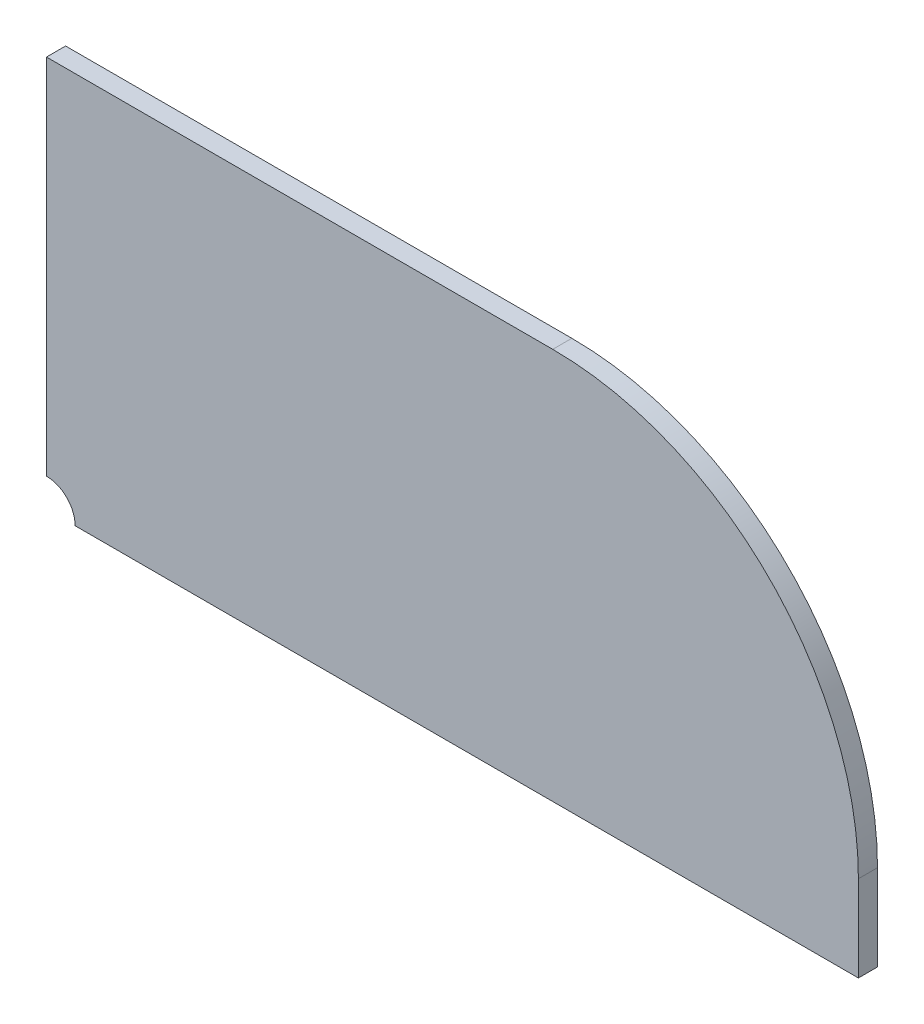
ISO-10303-21;
HEADER;
FILE_DESCRIPTION(('STEP AP214'),'2;1');
FILE_NAME('part.step','',(''),(''),'','','');
FILE_SCHEMA(('AUTOMOTIVE_DESIGN { 1 0 10303 214 1 1 1 1 }'));
ENDSEC;
DATA;
#1=APPLICATION_CONTEXT('core data for automotive mechanical design processes');
#2=APPLICATION_PROTOCOL_DEFINITION('international standard','automotive_design',2000,#1);
#3=PRODUCT_CONTEXT('',#1,'mechanical');
#4=PRODUCT('Part','Part','',(#3));
#5=PRODUCT_RELATED_PRODUCT_CATEGORY('part','',(#4));
#6=PRODUCT_DEFINITION_FORMATION('','',#4);
#7=PRODUCT_DEFINITION_CONTEXT('part definition',#1,'design');
#8=PRODUCT_DEFINITION('design','',#6,#7);
#9=PRODUCT_DEFINITION_SHAPE('','',#8);
#10=(LENGTH_UNIT() NAMED_UNIT(*) SI_UNIT(.MILLI.,.METRE.));
#11=(NAMED_UNIT(*) PLANE_ANGLE_UNIT() SI_UNIT($,.RADIAN.));
#12=(NAMED_UNIT(*) SI_UNIT($,.STERADIAN.) SOLID_ANGLE_UNIT());
#13=UNCERTAINTY_MEASURE_WITH_UNIT(LENGTH_MEASURE(1.E-05),#10,'distance_accuracy_value','');
#14=(GEOMETRIC_REPRESENTATION_CONTEXT(3) GLOBAL_UNCERTAINTY_ASSIGNED_CONTEXT((#13)) GLOBAL_UNIT_ASSIGNED_CONTEXT((#10,
#11,#12)) REPRESENTATION_CONTEXT('',''));
#15=CARTESIAN_POINT('',(0.,0.,0.));
#16=DIRECTION('',(0.,0.,1.));
#17=DIRECTION('',(1.,0.,0.));
#18=AXIS2_PLACEMENT_3D('',#15,#16,#17);
#19=CARTESIAN_POINT('',(26.5,4.5,-1.));
#20=DIRECTION('',(0.,0.,1.));
#21=DIRECTION('',(1.,0.,0.));
#22=AXIS2_PLACEMENT_3D('',#19,#20,#21);
#23=CYLINDRICAL_SURFACE('',#22,16.);
#24=CARTESIAN_POINT('',(26.5,4.5,0.));
#25=DIRECTION('',(0.,0.,1.));
#26=DIRECTION('',(1.,0.,0.));
#27=AXIS2_PLACEMENT_3D('',#24,#25,#26);
#28=CIRCLE('',#27,16.);
#29=CARTESIAN_POINT('',(42.5,4.5,0.));
#30=VERTEX_POINT('',#29);
#31=CARTESIAN_POINT('',(26.5,20.5,0.));
#32=VERTEX_POINT('',#31);
#33=EDGE_CURVE('E124',#30,#32,#28,.T.);
#34=ORIENTED_EDGE('',*,*,#33,.F.);
#35=DIRECTION('',(0.,0.,1.));
#36=VECTOR('',#35,1.);
#37=CARTESIAN_POINT('',(42.5,4.5,-1.));
#38=LINE('',#37,#36);
#39=CARTESIAN_POINT('',(42.5,4.5,-1.));
#40=VERTEX_POINT('',#39);
#41=EDGE_CURVE('E11',#40,#30,#38,.T.);
#42=ORIENTED_EDGE('',*,*,#41,.F.);
#43=CARTESIAN_POINT('',(26.5,4.5,-1.));
#44=DIRECTION('',(0.,0.,1.));
#45=DIRECTION('',(1.,0.,0.));
#46=AXIS2_PLACEMENT_3D('',#43,#44,#45);
#47=CIRCLE('',#46,16.);
#48=CARTESIAN_POINT('',(26.5,20.5,-1.));
#49=VERTEX_POINT('',#48);
#50=EDGE_CURVE('E138',#40,#49,#47,.T.);
#51=ORIENTED_EDGE('',*,*,#50,.T.);
#52=DIRECTION('',(0.,0.,1.));
#53=VECTOR('',#52,1.);
#54=CARTESIAN_POINT('',(26.5,20.5,-1.));
#55=LINE('',#54,#53);
#56=EDGE_CURVE('E42',#49,#32,#55,.T.);
#57=ORIENTED_EDGE('',*,*,#56,.T.);
#58=EDGE_LOOP('',(#34,#42,#51,#57));
#59=FACE_BOUND('',#58,.T.);
#60=ADVANCED_FACE('F39',(#59),#23,.T.);
#61=CARTESIAN_POINT('',(42.5,4.5,-1.));
#62=DIRECTION('',(1.,0.,0.));
#63=DIRECTION('',(0.,0.,-1.));
#64=AXIS2_PLACEMENT_3D('',#61,#62,#63);
#65=PLANE('',#64);
#66=DIRECTION('',(0.,1.,0.));
#67=VECTOR('',#66,1.);
#68=CARTESIAN_POINT('',(42.5,4.5,0.));
#69=LINE('',#68,#67);
#70=CARTESIAN_POINT('',(42.5,0.,0.));
#71=VERTEX_POINT('',#70);
#72=EDGE_CURVE('E136',#71,#30,#69,.T.);
#73=ORIENTED_EDGE('',*,*,#72,.F.);
#74=DIRECTION('',(0.,0.,1.));
#75=VECTOR('',#74,1.);
#76=CARTESIAN_POINT('',(42.5,0.,-1.));
#77=LINE('',#76,#75);
#78=CARTESIAN_POINT('',(42.5,0.,-1.));
#79=VERTEX_POINT('',#78);
#80=EDGE_CURVE('E48',#79,#71,#77,.T.);
#81=ORIENTED_EDGE('',*,*,#80,.F.);
#82=DIRECTION('',(0.,1.,0.));
#83=VECTOR('',#82,1.);
#84=CARTESIAN_POINT('',(42.5,4.5,-1.));
#85=LINE('',#84,#83);
#86=EDGE_CURVE('E114',#79,#40,#85,.T.);
#87=ORIENTED_EDGE('',*,*,#86,.T.);
#88=ORIENTED_EDGE('',*,*,#41,.T.);
#89=EDGE_LOOP('',(#73,#81,#87,#88));
#90=FACE_BOUND('',#89,.T.);
#91=ADVANCED_FACE('F146',(#90),#65,.T.);
#92=CARTESIAN_POINT('',(42.5,0.,-1.));
#93=DIRECTION('',(0.,-1.,0.));
#94=DIRECTION('',(1.,0.,0.));
#95=AXIS2_PLACEMENT_3D('',#92,#93,#94);
#96=PLANE('',#95);
#97=DIRECTION('',(1.,0.,0.));
#98=VECTOR('',#97,1.);
#99=CARTESIAN_POINT('',(42.5,0.,0.));
#100=LINE('',#99,#98);
#101=CARTESIAN_POINT('',(1.5,0.,0.));
#102=VERTEX_POINT('',#101);
#103=EDGE_CURVE('E101',#102,#71,#100,.T.);
#104=ORIENTED_EDGE('',*,*,#103,.F.);
#105=DIRECTION('',(0.,0.,1.));
#106=VECTOR('',#105,1.);
#107=CARTESIAN_POINT('',(1.5,0.,-1.));
#108=LINE('',#107,#106);
#109=CARTESIAN_POINT('',(1.5,0.,-1.));
#110=VERTEX_POINT('',#109);
#111=EDGE_CURVE('E96',#110,#102,#108,.T.);
#112=ORIENTED_EDGE('',*,*,#111,.F.);
#113=DIRECTION('',(1.,0.,0.));
#114=VECTOR('',#113,1.);
#115=CARTESIAN_POINT('',(42.5,0.,-1.));
#116=LINE('',#115,#114);
#117=EDGE_CURVE('E99',#110,#79,#116,.T.);
#118=ORIENTED_EDGE('',*,*,#117,.T.);
#119=ORIENTED_EDGE('',*,*,#80,.T.);
#120=EDGE_LOOP('',(#104,#112,#118,#119));
#121=FACE_BOUND('',#120,.T.);
#122=ADVANCED_FACE('F98',(#121),#96,.T.);
#123=CARTESIAN_POINT('',(0.,0.,-1.));
#124=DIRECTION('',(0.,0.,1.));
#125=DIRECTION('',(1.,0.,0.));
#126=AXIS2_PLACEMENT_3D('',#123,#124,#125);
#127=CYLINDRICAL_SURFACE('',#126,1.5);
#128=CARTESIAN_POINT('',(0.,0.,0.));
#129=DIRECTION('',(0.,0.,-1.));
#130=DIRECTION('',(1.,0.,0.));
#131=AXIS2_PLACEMENT_3D('',#128,#129,#130);
#132=CIRCLE('',#131,1.5);
#133=CARTESIAN_POINT('',(0.,1.5,0.));
#134=VERTEX_POINT('',#133);
#135=EDGE_CURVE('E133',#134,#102,#132,.T.);
#136=ORIENTED_EDGE('',*,*,#135,.F.);
#137=DIRECTION('',(0.,0.,1.));
#138=VECTOR('',#137,1.);
#139=CARTESIAN_POINT('',(0.,1.5,-1.));
#140=LINE('',#139,#138);
#141=CARTESIAN_POINT('',(0.,1.5,-1.));
#142=VERTEX_POINT('',#141);
#143=EDGE_CURVE('E106',#142,#134,#140,.T.);
#144=ORIENTED_EDGE('',*,*,#143,.F.);
#145=CARTESIAN_POINT('',(0.,0.,-1.));
#146=DIRECTION('',(0.,0.,-1.));
#147=DIRECTION('',(1.,0.,0.));
#148=AXIS2_PLACEMENT_3D('',#145,#146,#147);
#149=CIRCLE('',#148,1.5);
#150=EDGE_CURVE('E112',#142,#110,#149,.T.);
#151=ORIENTED_EDGE('',*,*,#150,.T.);
#152=ORIENTED_EDGE('',*,*,#111,.T.);
#153=EDGE_LOOP('',(#136,#144,#151,#152));
#154=FACE_BOUND('',#153,.T.);
#155=ADVANCED_FACE('F116',(#154),#127,.F.);
#156=CARTESIAN_POINT('',(0.,1.5,-1.));
#157=DIRECTION('',(-1.,0.,0.));
#158=DIRECTION('',(0.,0.,1.));
#159=AXIS2_PLACEMENT_3D('',#156,#157,#158);
#160=PLANE('',#159);
#161=DIRECTION('',(0.,-1.,0.));
#162=VECTOR('',#161,1.);
#163=CARTESIAN_POINT('',(0.,1.5,0.));
#164=LINE('',#163,#162);
#165=CARTESIAN_POINT('',(0.,20.5,0.));
#166=VERTEX_POINT('',#165);
#167=EDGE_CURVE('E130',#166,#134,#164,.T.);
#168=ORIENTED_EDGE('',*,*,#167,.F.);
#169=DIRECTION('',(0.,0.,1.));
#170=VECTOR('',#169,1.);
#171=CARTESIAN_POINT('',(0.,20.5,-1.));
#172=LINE('',#171,#170);
#173=CARTESIAN_POINT('',(0.,20.5,-1.));
#174=VERTEX_POINT('',#173);
#175=EDGE_CURVE('E141',#174,#166,#172,.T.);
#176=ORIENTED_EDGE('',*,*,#175,.F.);
#177=DIRECTION('',(0.,-1.,0.));
#178=VECTOR('',#177,1.);
#179=CARTESIAN_POINT('',(0.,1.5,-1.));
#180=LINE('',#179,#178);
#181=EDGE_CURVE('E117',#174,#142,#180,.T.);
#182=ORIENTED_EDGE('',*,*,#181,.T.);
#183=ORIENTED_EDGE('',*,*,#143,.T.);
#184=EDGE_LOOP('',(#168,#176,#182,#183));
#185=FACE_BOUND('',#184,.T.);
#186=ADVANCED_FACE('F159',(#185),#160,.T.);
#187=CARTESIAN_POINT('',(0.,20.5,-1.));
#188=DIRECTION('',(0.,1.,0.));
#189=DIRECTION('',(0.,0.,1.));
#190=AXIS2_PLACEMENT_3D('',#187,#188,#189);
#191=PLANE('',#190);
#192=DIRECTION('',(-1.,0.,0.));
#193=VECTOR('',#192,1.);
#194=CARTESIAN_POINT('',(0.,20.5,0.));
#195=LINE('',#194,#193);
#196=EDGE_CURVE('E127',#32,#166,#195,.T.);
#197=ORIENTED_EDGE('',*,*,#196,.F.);
#198=ORIENTED_EDGE('',*,*,#56,.F.);
#199=DIRECTION('',(-1.,0.,0.));
#200=VECTOR('',#199,1.);
#201=CARTESIAN_POINT('',(0.,20.5,-1.));
#202=LINE('',#201,#200);
#203=EDGE_CURVE('E119',#49,#174,#202,.T.);
#204=ORIENTED_EDGE('',*,*,#203,.T.);
#205=ORIENTED_EDGE('',*,*,#175,.T.);
#206=EDGE_LOOP('',(#197,#198,#204,#205));
#207=FACE_BOUND('',#206,.T.);
#208=ADVANCED_FACE('F143',(#207),#191,.T.);
#209=CARTESIAN_POINT('',(26.5,4.5,-1.));
#210=DIRECTION('',(0.,0.,1.));
#211=DIRECTION('',(1.,0.,0.));
#212=AXIS2_PLACEMENT_3D('',#209,#210,#211);
#213=PLANE('',#212);
#214=ORIENTED_EDGE('',*,*,#50,.F.);
#215=ORIENTED_EDGE('',*,*,#86,.F.);
#216=ORIENTED_EDGE('',*,*,#117,.F.);
#217=ORIENTED_EDGE('',*,*,#150,.F.);
#218=ORIENTED_EDGE('',*,*,#181,.F.);
#219=ORIENTED_EDGE('',*,*,#203,.F.);
#220=EDGE_LOOP('',(#214,#215,#216,#217,#218,#219));
#221=FACE_BOUND('',#220,.T.);
#222=ADVANCED_FACE('F110',(#221),#213,.F.);
#223=CARTESIAN_POINT('',(26.5,4.5,0.));
#224=DIRECTION('',(0.,0.,1.));
#225=DIRECTION('',(1.,0.,0.));
#226=AXIS2_PLACEMENT_3D('',#223,#224,#225);
#227=PLANE('',#226);
#228=ORIENTED_EDGE('',*,*,#33,.T.);
#229=ORIENTED_EDGE('',*,*,#196,.T.);
#230=ORIENTED_EDGE('',*,*,#167,.T.);
#231=ORIENTED_EDGE('',*,*,#135,.T.);
#232=ORIENTED_EDGE('',*,*,#103,.T.);
#233=ORIENTED_EDGE('',*,*,#72,.T.);
#234=EDGE_LOOP('',(#228,#229,#230,#231,#232,#233));
#235=FACE_BOUND('',#234,.T.);
#236=ADVANCED_FACE('F145',(#235),#227,.T.);
#237=CLOSED_SHELL('',(#60,#91,#122,#155,#186,#208,#222,#236));
#238=MANIFOLD_SOLID_BREP('B2',#237);
#239=ADVANCED_BREP_SHAPE_REPRESENTATION('',(#18,#238),#14);
#240=SHAPE_DEFINITION_REPRESENTATION(#9,#239);
ENDSEC;
END-ISO-10303-21;
